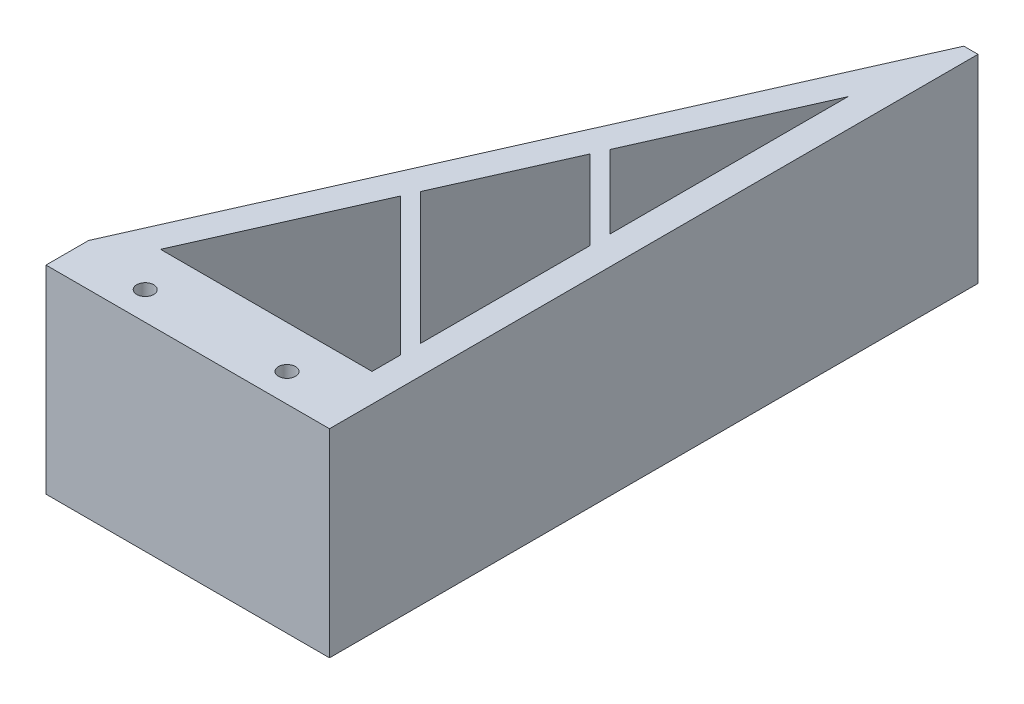
ISO-10303-21;
HEADER;
FILE_DESCRIPTION(('STEP AP214'),'2;1');
FILE_NAME('part.step','',(''),(''),'','','');
FILE_SCHEMA(('AUTOMOTIVE_DESIGN { 1 0 10303 214 1 1 1 1 }'));
ENDSEC;
DATA;
#1=APPLICATION_CONTEXT('core data for automotive mechanical design processes');
#2=APPLICATION_PROTOCOL_DEFINITION('international standard','automotive_design',2000,#1);
#3=PRODUCT_CONTEXT('',#1,'mechanical');
#4=PRODUCT('Part','Part','',(#3));
#5=PRODUCT_RELATED_PRODUCT_CATEGORY('part','',(#4));
#6=PRODUCT_DEFINITION_FORMATION('','',#4);
#7=PRODUCT_DEFINITION_CONTEXT('part definition',#1,'design');
#8=PRODUCT_DEFINITION('design','',#6,#7);
#9=PRODUCT_DEFINITION_SHAPE('','',#8);
#10=(LENGTH_UNIT() NAMED_UNIT(*) SI_UNIT(.MILLI.,.METRE.));
#11=(NAMED_UNIT(*) PLANE_ANGLE_UNIT() SI_UNIT($,.RADIAN.));
#12=(NAMED_UNIT(*) SI_UNIT($,.STERADIAN.) SOLID_ANGLE_UNIT());
#13=UNCERTAINTY_MEASURE_WITH_UNIT(LENGTH_MEASURE(1.E-05),#10,'distance_accuracy_value','');
#14=(GEOMETRIC_REPRESENTATION_CONTEXT(3) GLOBAL_UNCERTAINTY_ASSIGNED_CONTEXT((#13)) GLOBAL_UNIT_ASSIGNED_CONTEXT((#10,
#11,#12)) REPRESENTATION_CONTEXT('',''));
#15=CARTESIAN_POINT('',(0.,0.,0.));
#16=DIRECTION('',(0.,0.,1.));
#17=DIRECTION('',(1.,0.,0.));
#18=AXIS2_PLACEMENT_3D('',#15,#16,#17);
#19=CARTESIAN_POINT('',(7.71793444824044,14.,21.134647491459));
#20=DIRECTION('',(-1.,0.,0.));
#21=DIRECTION('',(0.,0.,1.));
#22=AXIS2_PLACEMENT_3D('',#19,#20,#21);
#23=PLANE('',#22);
#24=DIRECTION('',(0.,0.,-1.));
#25=VECTOR('',#24,1.);
#26=CARTESIAN_POINT('',(7.71793444824044,0.,21.134647491459));
#27=LINE('',#26,#25);
#28=CARTESIAN_POINT('',(7.71793444824044,0.,4.34686194190802));
#29=VERTEX_POINT('',#28);
#30=CARTESIAN_POINT('',(7.71793444824044,0.,-12.4409236076429));
#31=VERTEX_POINT('',#30);
#32=EDGE_CURVE('E163',#29,#31,#27,.T.);
#33=ORIENTED_EDGE('',*,*,#32,.F.);
#34=DIRECTION('',(0.,-1.,0.));
#35=VECTOR('',#34,1.);
#36=CARTESIAN_POINT('',(7.71793444824044,14.,4.34686194190802));
#37=LINE('',#36,#35);
#38=CARTESIAN_POINT('',(7.71793444824044,14.,4.34686194190802));
#39=VERTEX_POINT('',#38);
#40=EDGE_CURVE('E53',#39,#29,#37,.T.);
#41=ORIENTED_EDGE('',*,*,#40,.F.);
#42=DIRECTION('',(0.,0.,-1.));
#43=VECTOR('',#42,1.);
#44=CARTESIAN_POINT('',(7.71793444824044,14.,21.134647491459));
#45=LINE('',#44,#43);
#46=CARTESIAN_POINT('',(7.71793444824044,14.,-12.4409236076429));
#47=VERTEX_POINT('',#46);
#48=EDGE_CURVE('E161',#39,#47,#45,.T.);
#49=ORIENTED_EDGE('',*,*,#48,.T.);
#50=DIRECTION('',(0.,-1.,0.));
#51=VECTOR('',#50,1.);
#52=CARTESIAN_POINT('',(7.71793444824044,14.,-12.4409236076429));
#53=LINE('',#52,#51);
#54=EDGE_CURVE('E192',#47,#31,#53,.T.);
#55=ORIENTED_EDGE('',*,*,#54,.T.);
#56=EDGE_LOOP('',(#33,#41,#49,#55));
#57=FACE_BOUND('',#56,.T.);
#58=ADVANCED_FACE('F38',(#57),#23,.T.);
#59=CARTESIAN_POINT('',(7.71793444824044,14.,17.7204339290859));
#60=VERTEX_POINT('',#59);
#61=CARTESIAN_POINT('',(7.71793444824044,14.,5.76107550428112));
#62=VERTEX_POINT('',#61);
#63=EDGE_CURVE('E169',#60,#62,#45,.T.);
#64=ORIENTED_EDGE('',*,*,#63,.T.);
#65=DIRECTION('',(0.,-1.,0.));
#66=VECTOR('',#65,1.);
#67=CARTESIAN_POINT('',(7.71793444824044,14.,5.76107550428112));
#68=LINE('',#67,#66);
#69=CARTESIAN_POINT('',(7.71793444824044,0.,5.76107550428112));
#70=VERTEX_POINT('',#69);
#71=EDGE_CURVE('E274',#62,#70,#68,.T.);
#72=ORIENTED_EDGE('',*,*,#71,.T.);
#73=CARTESIAN_POINT('',(7.71793444824044,0.,17.7204339290859));
#74=VERTEX_POINT('',#73);
#75=EDGE_CURVE('E268',#74,#70,#27,.T.);
#76=ORIENTED_EDGE('',*,*,#75,.F.);
#77=DIRECTION('',(0.,-1.,0.));
#78=VECTOR('',#77,1.);
#79=CARTESIAN_POINT('',(7.71793444824044,14.,17.7204339290859));
#80=LINE('',#79,#78);
#81=EDGE_CURVE('E11',#60,#74,#80,.T.);
#82=ORIENTED_EDGE('',*,*,#81,.F.);
#83=EDGE_LOOP('',(#64,#72,#76,#82));
#84=FACE_BOUND('',#83,.T.);
#85=ADVANCED_FACE('F271',(#84),#23,.T.);
#86=CARTESIAN_POINT('',(-7.20454159580486,14.,21.134647491459));
#87=DIRECTION('',(0.913811548620257,0.,0.406138466053448));
#88=DIRECTION('',(0.406138466053448,0.,-0.913811548620257));
#89=AXIS2_PLACEMENT_3D('',#86,#87,#88);
#90=PLANE('',#89);
#91=DIRECTION('',(-0.406138466053448,0.,0.913811548620257));
#92=VECTOR('',#91,1.);
#93=CARTESIAN_POINT('',(-7.20454159580486,14.,21.134647491459));
#94=LINE('',#93,#92);
#95=CARTESIAN_POINT('',(2.55246197145554,14.,-0.818610534876901));
#96=VERTEX_POINT('',#95);
#97=EDGE_CURVE('E168',#47,#96,#94,.T.);
#98=ORIENTED_EDGE('',*,*,#97,.T.);
#99=DIRECTION('',(0.,-1.,0.));
#100=VECTOR('',#99,1.);
#101=CARTESIAN_POINT('',(2.55246197145554,14.,-0.818610534876901));
#102=LINE('',#101,#100);
#103=CARTESIAN_POINT('',(2.55246197145554,0.,-0.818610534876901));
#104=VERTEX_POINT('',#103);
#105=EDGE_CURVE('E151',#96,#104,#102,.T.);
#106=ORIENTED_EDGE('',*,*,#105,.T.);
#107=DIRECTION('',(-0.406138466053448,0.,0.913811548620257));
#108=VECTOR('',#107,1.);
#109=CARTESIAN_POINT('',(-7.20454159580486,0.,21.134647491459));
#110=LINE('',#109,#108);
#111=EDGE_CURVE('E174',#31,#104,#110,.T.);
#112=ORIENTED_EDGE('',*,*,#111,.F.);
#113=ORIENTED_EDGE('',*,*,#54,.F.);
#114=EDGE_LOOP('',(#98,#106,#112,#113));
#115=FACE_BOUND('',#114,.T.);
#116=ADVANCED_FACE('F295',(#115),#90,.T.);
#117=CARTESIAN_POINT('',(2.1173193368792,0.,0.160460392919861));
#118=VERTEX_POINT('',#117);
#119=CARTESIAN_POINT('',(-1.56248325536842,0.,8.440016225477));
#120=VERTEX_POINT('',#119);
#121=EDGE_CURVE('E260',#118,#120,#110,.T.);
#122=ORIENTED_EDGE('',*,*,#121,.F.);
#123=DIRECTION('',(0.,-1.,0.));
#124=VECTOR('',#123,1.);
#125=CARTESIAN_POINT('',(2.1173193368792,14.,0.160460392919857));
#126=LINE('',#125,#124);
#127=CARTESIAN_POINT('',(2.1173193368792,14.,0.160460392919857));
#128=VERTEX_POINT('',#127);
#129=EDGE_CURVE('E296',#128,#118,#126,.T.);
#130=ORIENTED_EDGE('',*,*,#129,.F.);
#131=CARTESIAN_POINT('',(-1.56248325536842,14.,8.440016225477));
#132=VERTEX_POINT('',#131);
#133=EDGE_CURVE('E183',#128,#132,#94,.T.);
#134=ORIENTED_EDGE('',*,*,#133,.T.);
#135=DIRECTION('',(0.,-1.,0.));
#136=VECTOR('',#135,1.);
#137=CARTESIAN_POINT('',(-1.56248325536842,14.,8.440016225477));
#138=LINE('',#137,#136);
#139=EDGE_CURVE('E46',#132,#120,#138,.T.);
#140=ORIENTED_EDGE('',*,*,#139,.T.);
#141=EDGE_LOOP('',(#122,#130,#134,#140));
#142=FACE_BOUND('',#141,.T.);
#143=ADVANCED_FACE('F258',(#142),#90,.T.);
#144=CARTESIAN_POINT('',(-1.56248325536842,14.,8.440016225477));
#145=DIRECTION('',(-0.707106781186549,0.,0.707106781186546));
#146=DIRECTION('',(0.707106781186546,0.,0.707106781186549));
#147=AXIS2_PLACEMENT_3D('',#144,#145,#146);
#148=PLANE('',#147);
#149=DIRECTION('',(-0.707106781186546,0.,-0.707106781186549));
#150=VECTOR('',#149,1.);
#151=CARTESIAN_POINT('',(-1.56248325536842,0.,8.440016225477));
#152=LINE('',#151,#150);
#153=EDGE_CURVE('E240',#74,#120,#152,.T.);
#154=ORIENTED_EDGE('',*,*,#153,.T.);
#155=ORIENTED_EDGE('',*,*,#139,.F.);
#156=DIRECTION('',(-0.707106781186546,0.,-0.707106781186549));
#157=VECTOR('',#156,1.);
#158=CARTESIAN_POINT('',(-1.56248325536842,14.,8.440016225477));
#159=LINE('',#158,#157);
#160=EDGE_CURVE('E241',#60,#132,#159,.T.);
#161=ORIENTED_EDGE('',*,*,#160,.F.);
#162=ORIENTED_EDGE('',*,*,#81,.T.);
#163=EDGE_LOOP('',(#154,#155,#161,#162));
#164=FACE_BOUND('',#163,.T.);
#165=ADVANCED_FACE('F40',(#164),#148,.F.);
#166=CARTESIAN_POINT('',(7.71793444824044,14.,19.134647491459));
#167=DIRECTION('',(0.707106781186549,0.,-0.707106781186547));
#168=DIRECTION('',(-0.707106781186546,0.,-0.707106781186549));
#169=AXIS2_PLACEMENT_3D('',#166,#167,#168);
#170=PLANE('',#169);
#171=DIRECTION('',(0.707106781186546,0.,0.707106781186549));
#172=VECTOR('',#171,1.);
#173=CARTESIAN_POINT('',(7.71793444824044,0.,19.134647491459));
#174=LINE('',#173,#172);
#175=CARTESIAN_POINT('',(-1.99762588994476,0.,9.41908715327376));
#176=VERTEX_POINT('',#175);
#177=CARTESIAN_POINT('',(7.71793444824044,0.,19.134647491459));
#178=VERTEX_POINT('',#177);
#179=EDGE_CURVE('E245',#176,#178,#174,.T.);
#180=ORIENTED_EDGE('',*,*,#179,.T.);
#181=DIRECTION('',(0.,-1.,0.));
#182=VECTOR('',#181,1.);
#183=CARTESIAN_POINT('',(7.71793444824044,14.,19.134647491459));
#184=LINE('',#183,#182);
#185=CARTESIAN_POINT('',(7.71793444824044,14.,19.134647491459));
#186=VERTEX_POINT('',#185);
#187=EDGE_CURVE('E247',#186,#178,#184,.T.);
#188=ORIENTED_EDGE('',*,*,#187,.F.);
#189=DIRECTION('',(0.707106781186546,0.,0.707106781186549));
#190=VECTOR('',#189,1.);
#191=CARTESIAN_POINT('',(7.71793444824044,14.,19.134647491459));
#192=LINE('',#191,#190);
#193=CARTESIAN_POINT('',(-1.99762588994476,14.,9.41908715327376));
#194=VERTEX_POINT('',#193);
#195=EDGE_CURVE('E244',#194,#186,#192,.T.);
#196=ORIENTED_EDGE('',*,*,#195,.F.);
#197=DIRECTION('',(0.,-1.,0.));
#198=VECTOR('',#197,1.);
#199=CARTESIAN_POINT('',(-1.99762588994476,14.,9.41908715327376));
#200=LINE('',#199,#198);
#201=EDGE_CURVE('E252',#194,#176,#200,.T.);
#202=ORIENTED_EDGE('',*,*,#201,.T.);
#203=EDGE_LOOP('',(#180,#188,#196,#202));
#204=FACE_BOUND('',#203,.T.);
#205=ADVANCED_FACE('F289',(#204),#170,.F.);
#206=CARTESIAN_POINT('',(0.,14.,0.));
#207=DIRECTION('',(0.,-1.,0.));
#208=DIRECTION('',(0.,0.,-1.));
#209=AXIS2_PLACEMENT_3D('',#206,#207,#208);
#210=PLANE('',#209);
#211=CARTESIAN_POINT('',(4.71793444824044,14.,24.134647491459));
#212=DIRECTION('',(0.,1.,0.));
#213=DIRECTION('',(0.,0.,1.));
#214=AXIS2_PLACEMENT_3D('',#211,#212,#213);
#215=CIRCLE('',#214,0.6);
#216=CARTESIAN_POINT('',(4.71793444824044,14.,24.734647491459));
#217=VERTEX_POINT('',#216);
#218=EDGE_CURVE('E311',#217,#217,#215,.T.);
#219=ORIENTED_EDGE('',*,*,#218,.F.);
#220=EDGE_LOOP('',(#219));
#221=FACE_BOUND('',#220,.T.);
#222=CARTESIAN_POINT('',(-5.28206555175956,14.,24.134647491459));
#223=DIRECTION('',(0.,1.,0.));
#224=DIRECTION('',(0.,0.,1.));
#225=AXIS2_PLACEMENT_3D('',#222,#223,#224);
#226=CIRCLE('',#225,0.6);
#227=CARTESIAN_POINT('',(-5.28206555175956,14.,24.734647491459));
#228=VERTEX_POINT('',#227);
#229=EDGE_CURVE('E305',#228,#228,#226,.T.);
#230=ORIENTED_EDGE('',*,*,#229,.F.);
#231=EDGE_LOOP('',(#230));
#232=FACE_BOUND('',#231,.T.);
#233=ORIENTED_EDGE('',*,*,#48,.F.);
#234=DIRECTION('',(-0.707106781186546,0.,-0.707106781186549));
#235=VECTOR('',#234,1.);
#236=CARTESIAN_POINT('',(2.55246197145554,14.,-0.818610534876901));
#237=LINE('',#236,#235);
#238=EDGE_CURVE('E148',#39,#96,#237,.T.);
#239=ORIENTED_EDGE('',*,*,#238,.T.);
#240=ORIENTED_EDGE('',*,*,#97,.F.);
#241=EDGE_LOOP('',(#233,#239,#240));
#242=FACE_BOUND('',#241,.T.);
#243=ORIENTED_EDGE('',*,*,#63,.F.);
#244=ORIENTED_EDGE('',*,*,#160,.T.);
#245=ORIENTED_EDGE('',*,*,#133,.F.);
#246=DIRECTION('',(0.707106781186546,0.,0.707106781186549));
#247=VECTOR('',#246,1.);
#248=CARTESIAN_POINT('',(7.71793444824044,14.,5.76107550428112));
#249=LINE('',#248,#247);
#250=EDGE_CURVE('E156',#128,#62,#249,.T.);
#251=ORIENTED_EDGE('',*,*,#250,.T.);
#252=EDGE_LOOP('',(#243,#244,#245,#251));
#253=FACE_BOUND('',#252,.T.);
#254=ORIENTED_EDGE('',*,*,#195,.T.);
#255=CARTESIAN_POINT('',(7.71793444824044,14.,21.134647491459));
#256=VERTEX_POINT('',#255);
#257=EDGE_CURVE('E172',#256,#186,#45,.T.);
#258=ORIENTED_EDGE('',*,*,#257,.F.);
#259=DIRECTION('',(1.,0.,0.));
#260=VECTOR('',#259,1.);
#261=CARTESIAN_POINT('',(-7.20454159580486,14.,21.134647491459));
#262=LINE('',#261,#260);
#263=CARTESIAN_POINT('',(-7.20454159580486,14.,21.134647491459));
#264=VERTEX_POINT('',#263);
#265=EDGE_CURVE('E170',#264,#256,#262,.T.);
#266=ORIENTED_EDGE('',*,*,#265,.F.);
#267=EDGE_CURVE('E178',#194,#264,#94,.T.);
#268=ORIENTED_EDGE('',*,*,#267,.F.);
#269=EDGE_LOOP('',(#254,#258,#266,#268));
#270=FACE_BOUND('',#269,.T.);
#271=DIRECTION('',(0.,0.,1.));
#272=VECTOR('',#271,1.);
#273=CARTESIAN_POINT('',(-10.2820655517596,14.,23.134647491459));
#274=LINE('',#273,#272);
#275=CARTESIAN_POINT('',(-10.2820655517596,14.,23.134647491459));
#276=VERTEX_POINT('',#275);
#277=CARTESIAN_POINT('',(-10.2820655517596,14.,26.134647491459));
#278=VERTEX_POINT('',#277);
#279=EDGE_CURVE('E203',#276,#278,#274,.T.);
#280=ORIENTED_EDGE('',*,*,#279,.T.);
#281=DIRECTION('',(1.,0.,0.));
#282=VECTOR('',#281,1.);
#283=CARTESIAN_POINT('',(-10.2820655517596,14.,26.134647491459));
#284=LINE('',#283,#282);
#285=CARTESIAN_POINT('',(9.71793444824044,14.,26.134647491459));
#286=VERTEX_POINT('',#285);
#287=EDGE_CURVE('E206',#278,#286,#284,.T.);
#288=ORIENTED_EDGE('',*,*,#287,.T.);
#289=DIRECTION('',(0.,0.,-1.));
#290=VECTOR('',#289,1.);
#291=CARTESIAN_POINT('',(9.71793444824044,14.,23.134647491459));
#292=LINE('',#291,#290);
#293=CARTESIAN_POINT('',(9.71793444824045,14.,-19.615352508541));
#294=VERTEX_POINT('',#293);
#295=EDGE_CURVE('E209',#286,#294,#292,.T.);
#296=ORIENTED_EDGE('',*,*,#295,.T.);
#297=DIRECTION('',(-1.,0.,0.));
#298=VECTOR('',#297,1.);
#299=CARTESIAN_POINT('',(8.71793444824045,14.,-19.615352508541));
#300=LINE('',#299,#298);
#301=CARTESIAN_POINT('',(8.71793444824045,14.,-19.615352508541));
#302=VERTEX_POINT('',#301);
#303=EDGE_CURVE('E211',#294,#302,#300,.T.);
#304=ORIENTED_EDGE('',*,*,#303,.T.);
#305=DIRECTION('',(-0.406138466053448,0.,0.913811548620257));
#306=VECTOR('',#305,1.);
#307=CARTESIAN_POINT('',(-10.2820655517596,14.,23.134647491459));
#308=LINE('',#307,#306);
#309=EDGE_CURVE('E213',#302,#276,#308,.T.);
#310=ORIENTED_EDGE('',*,*,#309,.T.);
#311=EDGE_LOOP('',(#280,#288,#296,#304,#310));
#312=FACE_BOUND('',#311,.T.);
#313=ADVANCED_FACE('F166',(#221,#232,#242,#253,#270,#312),#210,.F.);
#314=CARTESIAN_POINT('',(0.,0.,0.));
#315=DIRECTION('',(0.,-1.,0.));
#316=DIRECTION('',(0.,0.,-1.));
#317=AXIS2_PLACEMENT_3D('',#314,#315,#316);
#318=PLANE('',#317);
#319=CARTESIAN_POINT('',(4.71793444824044,0.,24.134647491459));
#320=DIRECTION('',(0.,1.,0.));
#321=DIRECTION('',(0.,0.,1.));
#322=AXIS2_PLACEMENT_3D('',#319,#320,#321);
#323=CIRCLE('',#322,0.6);
#324=CARTESIAN_POINT('',(4.71793444824044,0.,24.734647491459));
#325=VERTEX_POINT('',#324);
#326=EDGE_CURVE('E303',#325,#325,#323,.T.);
#327=ORIENTED_EDGE('',*,*,#326,.T.);
#328=EDGE_LOOP('',(#327));
#329=FACE_BOUND('',#328,.T.);
#330=CARTESIAN_POINT('',(-5.28206555175956,0.,24.134647491459));
#331=DIRECTION('',(0.,1.,0.));
#332=DIRECTION('',(0.,0.,1.));
#333=AXIS2_PLACEMENT_3D('',#330,#331,#332);
#334=CIRCLE('',#333,0.6);
#335=CARTESIAN_POINT('',(-5.28206555175956,0.,24.734647491459));
#336=VERTEX_POINT('',#335);
#337=EDGE_CURVE('E308',#336,#336,#334,.T.);
#338=ORIENTED_EDGE('',*,*,#337,.T.);
#339=EDGE_LOOP('',(#338));
#340=FACE_BOUND('',#339,.T.);
#341=DIRECTION('',(-0.707106781186546,0.,-0.707106781186549));
#342=VECTOR('',#341,1.);
#343=CARTESIAN_POINT('',(2.55246197145554,0.,-0.818610534876901));
#344=LINE('',#343,#342);
#345=EDGE_CURVE('E294',#29,#104,#344,.T.);
#346=ORIENTED_EDGE('',*,*,#345,.F.);
#347=ORIENTED_EDGE('',*,*,#32,.T.);
#348=ORIENTED_EDGE('',*,*,#111,.T.);
#349=EDGE_LOOP('',(#346,#347,#348));
#350=FACE_BOUND('',#349,.T.);
#351=ORIENTED_EDGE('',*,*,#153,.F.);
#352=ORIENTED_EDGE('',*,*,#75,.T.);
#353=DIRECTION('',(0.707106781186546,0.,0.707106781186549));
#354=VECTOR('',#353,1.);
#355=CARTESIAN_POINT('',(7.71793444824044,0.,5.76107550428112));
#356=LINE('',#355,#354);
#357=EDGE_CURVE('E61',#118,#70,#356,.T.);
#358=ORIENTED_EDGE('',*,*,#357,.F.);
#359=ORIENTED_EDGE('',*,*,#121,.T.);
#360=EDGE_LOOP('',(#351,#352,#358,#359));
#361=FACE_BOUND('',#360,.T.);
#362=CARTESIAN_POINT('',(7.71793444824044,0.,21.134647491459));
#363=VERTEX_POINT('',#362);
#364=EDGE_CURVE('E275',#363,#178,#27,.T.);
#365=ORIENTED_EDGE('',*,*,#364,.T.);
#366=ORIENTED_EDGE('',*,*,#179,.F.);
#367=CARTESIAN_POINT('',(-7.20454159580486,0.,21.134647491459));
#368=VERTEX_POINT('',#367);
#369=EDGE_CURVE('E277',#176,#368,#110,.T.);
#370=ORIENTED_EDGE('',*,*,#369,.T.);
#371=DIRECTION('',(1.,0.,0.));
#372=VECTOR('',#371,1.);
#373=CARTESIAN_POINT('',(-7.20454159580486,0.,21.134647491459));
#374=LINE('',#373,#372);
#375=EDGE_CURVE('E164',#368,#363,#374,.T.);
#376=ORIENTED_EDGE('',*,*,#375,.T.);
#377=EDGE_LOOP('',(#365,#366,#370,#376));
#378=FACE_BOUND('',#377,.T.);
#379=DIRECTION('',(0.,0.,1.));
#380=VECTOR('',#379,1.);
#381=CARTESIAN_POINT('',(-10.2820655517596,0.,23.134647491459));
#382=LINE('',#381,#380);
#383=CARTESIAN_POINT('',(-10.2820655517596,0.,23.134647491459));
#384=VERTEX_POINT('',#383);
#385=CARTESIAN_POINT('',(-10.2820655517596,0.,26.134647491459));
#386=VERTEX_POINT('',#385);
#387=EDGE_CURVE('E202',#384,#386,#382,.T.);
#388=ORIENTED_EDGE('',*,*,#387,.F.);
#389=DIRECTION('',(-0.406138466053448,0.,0.913811548620257));
#390=VECTOR('',#389,1.);
#391=CARTESIAN_POINT('',(-10.2820655517596,0.,23.134647491459));
#392=LINE('',#391,#390);
#393=CARTESIAN_POINT('',(8.71793444824045,0.,-19.615352508541));
#394=VERTEX_POINT('',#393);
#395=EDGE_CURVE('E207',#394,#384,#392,.T.);
#396=ORIENTED_EDGE('',*,*,#395,.F.);
#397=DIRECTION('',(-1.,0.,0.));
#398=VECTOR('',#397,1.);
#399=CARTESIAN_POINT('',(8.71793444824045,0.,-19.615352508541));
#400=LINE('',#399,#398);
#401=CARTESIAN_POINT('',(9.71793444824045,0.,-19.615352508541));
#402=VERTEX_POINT('',#401);
#403=EDGE_CURVE('E223',#402,#394,#400,.T.);
#404=ORIENTED_EDGE('',*,*,#403,.F.);
#405=DIRECTION('',(0.,0.,-1.));
#406=VECTOR('',#405,1.);
#407=CARTESIAN_POINT('',(9.71793444824044,0.,23.134647491459));
#408=LINE('',#407,#406);
#409=CARTESIAN_POINT('',(9.71793444824044,0.,26.134647491459));
#410=VERTEX_POINT('',#409);
#411=EDGE_CURVE('E221',#410,#402,#408,.T.);
#412=ORIENTED_EDGE('',*,*,#411,.F.);
#413=DIRECTION('',(1.,0.,0.));
#414=VECTOR('',#413,1.);
#415=CARTESIAN_POINT('',(-10.2820655517596,0.,26.134647491459));
#416=LINE('',#415,#414);
#417=EDGE_CURVE('E218',#386,#410,#416,.T.);
#418=ORIENTED_EDGE('',*,*,#417,.F.);
#419=EDGE_LOOP('',(#388,#396,#404,#412,#418));
#420=FACE_BOUND('',#419,.T.);
#421=ADVANCED_FACE('F266',(#329,#340,#350,#361,#378,#420),#318,.T.);
#422=ORIENTED_EDGE('',*,*,#187,.T.);
#423=ORIENTED_EDGE('',*,*,#364,.F.);
#424=DIRECTION('',(0.,-1.,0.));
#425=VECTOR('',#424,1.);
#426=CARTESIAN_POINT('',(7.71793444824044,14.,21.134647491459));
#427=LINE('',#426,#425);
#428=EDGE_CURVE('E195',#256,#363,#427,.T.);
#429=ORIENTED_EDGE('',*,*,#428,.F.);
#430=ORIENTED_EDGE('',*,*,#257,.T.);
#431=EDGE_LOOP('',(#422,#423,#429,#430));
#432=FACE_BOUND('',#431,.T.);
#433=ADVANCED_FACE('F284',(#432),#23,.T.);
#434=ORIENTED_EDGE('',*,*,#201,.F.);
#435=ORIENTED_EDGE('',*,*,#267,.T.);
#436=DIRECTION('',(0.,-1.,0.));
#437=VECTOR('',#436,1.);
#438=CARTESIAN_POINT('',(-7.20454159580486,14.,21.134647491459));
#439=LINE('',#438,#437);
#440=EDGE_CURVE('E190',#264,#368,#439,.T.);
#441=ORIENTED_EDGE('',*,*,#440,.T.);
#442=ORIENTED_EDGE('',*,*,#369,.F.);
#443=EDGE_LOOP('',(#434,#435,#441,#442));
#444=FACE_BOUND('',#443,.T.);
#445=ADVANCED_FACE('F290',(#444),#90,.T.);
#446=CARTESIAN_POINT('',(-10.2820655517596,14.,23.134647491459));
#447=DIRECTION('',(1.,0.,0.));
#448=DIRECTION('',(0.,0.,-1.));
#449=AXIS2_PLACEMENT_3D('',#446,#447,#448);
#450=PLANE('',#449);
#451=ORIENTED_EDGE('',*,*,#387,.T.);
#452=DIRECTION('',(0.,-1.,0.));
#453=VECTOR('',#452,1.);
#454=CARTESIAN_POINT('',(-10.2820655517596,14.,26.134647491459));
#455=LINE('',#454,#453);
#456=EDGE_CURVE('E237',#278,#386,#455,.T.);
#457=ORIENTED_EDGE('',*,*,#456,.F.);
#458=ORIENTED_EDGE('',*,*,#279,.F.);
#459=DIRECTION('',(0.,-1.,0.));
#460=VECTOR('',#459,1.);
#461=CARTESIAN_POINT('',(-10.2820655517596,14.,23.134647491459));
#462=LINE('',#461,#460);
#463=EDGE_CURVE('E215',#276,#384,#462,.T.);
#464=ORIENTED_EDGE('',*,*,#463,.T.);
#465=EDGE_LOOP('',(#451,#457,#458,#464));
#466=FACE_BOUND('',#465,.T.);
#467=ADVANCED_FACE('F353',(#466),#450,.F.);
#468=CARTESIAN_POINT('',(-10.2820655517596,14.,26.134647491459));
#469=DIRECTION('',(0.,0.,-1.));
#470=DIRECTION('',(-1.,0.,0.));
#471=AXIS2_PLACEMENT_3D('',#468,#469,#470);
#472=PLANE('',#471);
#473=ORIENTED_EDGE('',*,*,#417,.T.);
#474=DIRECTION('',(0.,-1.,0.));
#475=VECTOR('',#474,1.);
#476=CARTESIAN_POINT('',(9.71793444824044,14.,26.134647491459));
#477=LINE('',#476,#475);
#478=EDGE_CURVE('E234',#286,#410,#477,.T.);
#479=ORIENTED_EDGE('',*,*,#478,.F.);
#480=ORIENTED_EDGE('',*,*,#287,.F.);
#481=ORIENTED_EDGE('',*,*,#456,.T.);
#482=EDGE_LOOP('',(#473,#479,#480,#481));
#483=FACE_BOUND('',#482,.T.);
#484=ADVANCED_FACE('F388',(#483),#472,.F.);
#485=CARTESIAN_POINT('',(9.71793444824044,14.,23.134647491459));
#486=DIRECTION('',(-1.,0.,0.));
#487=DIRECTION('',(0.,0.,1.));
#488=AXIS2_PLACEMENT_3D('',#485,#486,#487);
#489=PLANE('',#488);
#490=ORIENTED_EDGE('',*,*,#411,.T.);
#491=DIRECTION('',(0.,-1.,0.));
#492=VECTOR('',#491,1.);
#493=CARTESIAN_POINT('',(9.71793444824045,14.,-19.615352508541));
#494=LINE('',#493,#492);
#495=EDGE_CURVE('E231',#294,#402,#494,.T.);
#496=ORIENTED_EDGE('',*,*,#495,.F.);
#497=ORIENTED_EDGE('',*,*,#295,.F.);
#498=ORIENTED_EDGE('',*,*,#478,.T.);
#499=EDGE_LOOP('',(#490,#496,#497,#498));
#500=FACE_BOUND('',#499,.T.);
#501=ADVANCED_FACE('F384',(#500),#489,.F.);
#502=CARTESIAN_POINT('',(8.71793444824045,14.,-19.615352508541));
#503=DIRECTION('',(0.,0.,1.));
#504=DIRECTION('',(1.,0.,0.));
#505=AXIS2_PLACEMENT_3D('',#502,#503,#504);
#506=PLANE('',#505);
#507=ORIENTED_EDGE('',*,*,#403,.T.);
#508=DIRECTION('',(0.,-1.,0.));
#509=VECTOR('',#508,1.);
#510=CARTESIAN_POINT('',(8.71793444824045,14.,-19.615352508541));
#511=LINE('',#510,#509);
#512=EDGE_CURVE('E228',#302,#394,#511,.T.);
#513=ORIENTED_EDGE('',*,*,#512,.F.);
#514=ORIENTED_EDGE('',*,*,#303,.F.);
#515=ORIENTED_EDGE('',*,*,#495,.T.);
#516=EDGE_LOOP('',(#507,#513,#514,#515));
#517=FACE_BOUND('',#516,.T.);
#518=ADVANCED_FACE('F378',(#517),#506,.F.);
#519=CARTESIAN_POINT('',(-10.2820655517596,14.,23.134647491459));
#520=DIRECTION('',(0.913811548620257,0.,0.406138466053448));
#521=DIRECTION('',(0.406138466053448,0.,-0.913811548620257));
#522=AXIS2_PLACEMENT_3D('',#519,#520,#521);
#523=PLANE('',#522);
#524=ORIENTED_EDGE('',*,*,#395,.T.);
#525=ORIENTED_EDGE('',*,*,#463,.F.);
#526=ORIENTED_EDGE('',*,*,#309,.F.);
#527=ORIENTED_EDGE('',*,*,#512,.T.);
#528=EDGE_LOOP('',(#524,#525,#526,#527));
#529=FACE_BOUND('',#528,.T.);
#530=ADVANCED_FACE('F374',(#529),#523,.F.);
#531=CARTESIAN_POINT('',(-7.20454159580486,14.,21.134647491459));
#532=DIRECTION('',(0.,0.,-1.));
#533=DIRECTION('',(-1.,0.,0.));
#534=AXIS2_PLACEMENT_3D('',#531,#532,#533);
#535=PLANE('',#534);
#536=ORIENTED_EDGE('',*,*,#375,.F.);
#537=ORIENTED_EDGE('',*,*,#440,.F.);
#538=ORIENTED_EDGE('',*,*,#265,.T.);
#539=ORIENTED_EDGE('',*,*,#428,.T.);
#540=EDGE_LOOP('',(#536,#537,#538,#539));
#541=FACE_BOUND('',#540,.T.);
#542=ADVANCED_FACE('F282',(#541),#535,.T.);
#543=CARTESIAN_POINT('',(2.55246197145554,14.,-0.818610534876901));
#544=DIRECTION('',(-0.707106781186549,0.,0.707106781186546));
#545=DIRECTION('',(0.707106781186546,0.,0.707106781186549));
#546=AXIS2_PLACEMENT_3D('',#543,#544,#545);
#547=PLANE('',#546);
#548=ORIENTED_EDGE('',*,*,#345,.T.);
#549=ORIENTED_EDGE('',*,*,#105,.F.);
#550=ORIENTED_EDGE('',*,*,#238,.F.);
#551=ORIENTED_EDGE('',*,*,#40,.T.);
#552=EDGE_LOOP('',(#548,#549,#550,#551));
#553=FACE_BOUND('',#552,.T.);
#554=ADVANCED_FACE('F149',(#553),#547,.F.);
#555=CARTESIAN_POINT('',(7.71793444824044,14.,5.76107550428112));
#556=DIRECTION('',(0.707106781186549,0.,-0.707106781186546));
#557=DIRECTION('',(-0.707106781186546,0.,-0.707106781186549));
#558=AXIS2_PLACEMENT_3D('',#555,#556,#557);
#559=PLANE('',#558);
#560=ORIENTED_EDGE('',*,*,#357,.T.);
#561=ORIENTED_EDGE('',*,*,#71,.F.);
#562=ORIENTED_EDGE('',*,*,#250,.F.);
#563=ORIENTED_EDGE('',*,*,#129,.T.);
#564=EDGE_LOOP('',(#560,#561,#562,#563));
#565=FACE_BOUND('',#564,.T.);
#566=ADVANCED_FACE('F332',(#565),#559,.F.);
#567=CARTESIAN_POINT('',(-5.28206555175956,0.,24.134647491459));
#568=DIRECTION('',(0.,1.,0.));
#569=DIRECTION('',(0.,0.,1.));
#570=AXIS2_PLACEMENT_3D('',#567,#568,#569);
#571=CYLINDRICAL_SURFACE('',#570,0.6);
#572=ORIENTED_EDGE('',*,*,#337,.F.);
#573=EDGE_LOOP('',(#572));
#574=FACE_BOUND('',#573,.T.);
#575=ORIENTED_EDGE('',*,*,#229,.T.);
#576=EDGE_LOOP('',(#575));
#577=FACE_BOUND('',#576,.T.);
#578=ADVANCED_FACE('F322',(#574,#577),#571,.F.);
#579=CARTESIAN_POINT('',(4.71793444824044,0.,24.134647491459));
#580=DIRECTION('',(0.,1.,0.));
#581=DIRECTION('',(0.,0.,1.));
#582=AXIS2_PLACEMENT_3D('',#579,#580,#581);
#583=CYLINDRICAL_SURFACE('',#582,0.6);
#584=ORIENTED_EDGE('',*,*,#326,.F.);
#585=EDGE_LOOP('',(#584));
#586=FACE_BOUND('',#585,.T.);
#587=ORIENTED_EDGE('',*,*,#218,.T.);
#588=EDGE_LOOP('',(#587));
#589=FACE_BOUND('',#588,.T.);
#590=ADVANCED_FACE('F319',(#586,#589),#583,.F.);
#591=CLOSED_SHELL('',(#58,#85,#116,#143,#165,#205,#313,#421,#433,#445,#467,#484,#501,#518,#530,
#542,#554,#566,#578,#590));
#592=MANIFOLD_SOLID_BREP('B2',#591);
#593=ADVANCED_BREP_SHAPE_REPRESENTATION('',(#18,#592),#14);
#594=SHAPE_DEFINITION_REPRESENTATION(#9,#593);
ENDSEC;
END-ISO-10303-21;
